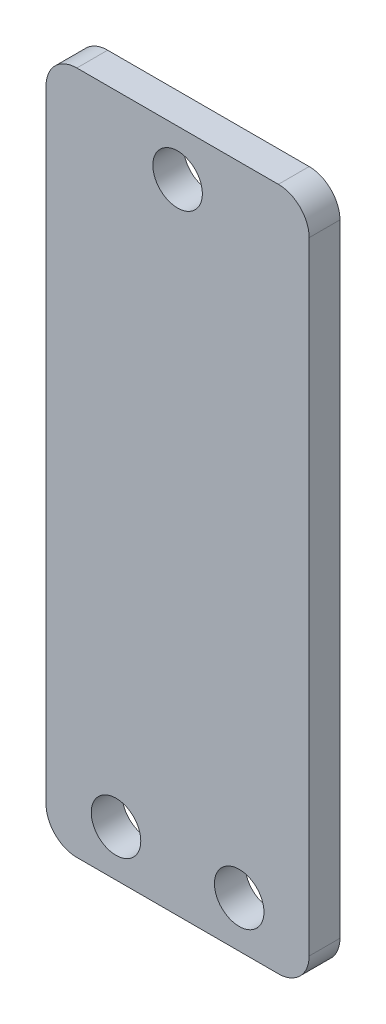
ISO-10303-21;
HEADER;
FILE_DESCRIPTION(('STEP AP214'),'2;1');
FILE_NAME('part.step','',(''),(''),'','','');
FILE_SCHEMA(('AUTOMOTIVE_DESIGN { 1 0 10303 214 1 1 1 1 }'));
ENDSEC;
DATA;
#1=APPLICATION_CONTEXT('core data for automotive mechanical design processes');
#2=APPLICATION_PROTOCOL_DEFINITION('international standard','automotive_design',2000,#1);
#3=PRODUCT_CONTEXT('',#1,'mechanical');
#4=PRODUCT('Part','Part','',(#3));
#5=PRODUCT_RELATED_PRODUCT_CATEGORY('part','',(#4));
#6=PRODUCT_DEFINITION_FORMATION('','',#4);
#7=PRODUCT_DEFINITION_CONTEXT('part definition',#1,'design');
#8=PRODUCT_DEFINITION('design','',#6,#7);
#9=PRODUCT_DEFINITION_SHAPE('','',#8);
#10=(LENGTH_UNIT() NAMED_UNIT(*) SI_UNIT(.MILLI.,.METRE.));
#11=(NAMED_UNIT(*) PLANE_ANGLE_UNIT() SI_UNIT($,.RADIAN.));
#12=(NAMED_UNIT(*) SI_UNIT($,.STERADIAN.) SOLID_ANGLE_UNIT());
#13=UNCERTAINTY_MEASURE_WITH_UNIT(LENGTH_MEASURE(1.E-05),#10,'distance_accuracy_value','');
#14=(GEOMETRIC_REPRESENTATION_CONTEXT(3) GLOBAL_UNCERTAINTY_ASSIGNED_CONTEXT((#13)) GLOBAL_UNIT_ASSIGNED_CONTEXT((#10,
#11,#12)) REPRESENTATION_CONTEXT('',''));
#15=CARTESIAN_POINT('',(0.,0.,0.));
#16=DIRECTION('',(0.,0.,1.));
#17=DIRECTION('',(1.,0.,0.));
#18=AXIS2_PLACEMENT_3D('',#15,#16,#17);
#19=CARTESIAN_POINT('',(10.3886,62.6618,3.175));
#20=DIRECTION('',(0.,0.,-1.));
#21=DIRECTION('',(-1.,0.,0.));
#22=AXIS2_PLACEMENT_3D('',#19,#20,#21);
#23=CYLINDRICAL_SURFACE('',#22,3.175);
#24=CARTESIAN_POINT('',(10.3886,62.6618,0.));
#25=DIRECTION('',(0.,0.,1.));
#26=DIRECTION('',(1.,0.,0.));
#27=AXIS2_PLACEMENT_3D('',#24,#25,#26);
#28=CIRCLE('',#27,3.175);
#29=CARTESIAN_POINT('',(13.5636,62.6617999999999,0.));
#30=VERTEX_POINT('',#29);
#31=CARTESIAN_POINT('',(10.3886,65.8368,0.));
#32=VERTEX_POINT('',#31);
#33=EDGE_CURVE('E129',#30,#32,#28,.T.);
#34=ORIENTED_EDGE('',*,*,#33,.T.);
#35=DIRECTION('',(0.,0.,-1.));
#36=VECTOR('',#35,1.);
#37=CARTESIAN_POINT('',(10.3886,65.8368,3.175));
#38=LINE('',#37,#36);
#39=CARTESIAN_POINT('',(10.3886,65.8368,3.175));
#40=VERTEX_POINT('',#39);
#41=EDGE_CURVE('E11',#40,#32,#38,.T.);
#42=ORIENTED_EDGE('',*,*,#41,.F.);
#43=CARTESIAN_POINT('',(10.3886,62.6618,3.175));
#44=DIRECTION('',(0.,0.,1.));
#45=DIRECTION('',(1.,0.,0.));
#46=AXIS2_PLACEMENT_3D('',#43,#44,#45);
#47=CIRCLE('',#46,3.175);
#48=CARTESIAN_POINT('',(13.5636,62.6617999999999,3.175));
#49=VERTEX_POINT('',#48);
#50=EDGE_CURVE('E144',#49,#40,#47,.T.);
#51=ORIENTED_EDGE('',*,*,#50,.F.);
#52=DIRECTION('',(0.,0.,-1.));
#53=VECTOR('',#52,1.);
#54=CARTESIAN_POINT('',(13.5636,62.6617999999999,3.175));
#55=LINE('',#54,#53);
#56=EDGE_CURVE('E125',#49,#30,#55,.T.);
#57=ORIENTED_EDGE('',*,*,#56,.T.);
#58=EDGE_LOOP('',(#34,#42,#51,#57));
#59=FACE_BOUND('',#58,.T.);
#60=ADVANCED_FACE('F33',(#59),#23,.T.);
#61=CARTESIAN_POINT('',(10.3886,65.8368,3.175));
#62=DIRECTION('',(0.,-1.,0.));
#63=DIRECTION('',(0.,0.,-1.));
#64=AXIS2_PLACEMENT_3D('',#61,#62,#63);
#65=PLANE('',#64);
#66=DIRECTION('',(-1.,0.,0.));
#67=VECTOR('',#66,1.);
#68=CARTESIAN_POINT('',(10.3886,65.8368,0.));
#69=LINE('',#68,#67);
#70=CARTESIAN_POINT('',(-10.3886,65.8368,0.));
#71=VERTEX_POINT('',#70);
#72=EDGE_CURVE('E132',#32,#71,#69,.T.);
#73=ORIENTED_EDGE('',*,*,#72,.T.);
#74=DIRECTION('',(0.,0.,-1.));
#75=VECTOR('',#74,1.);
#76=CARTESIAN_POINT('',(-10.3886,65.8368,3.175));
#77=LINE('',#76,#75);
#78=CARTESIAN_POINT('',(-10.3886,65.8368,3.175));
#79=VERTEX_POINT('',#78);
#80=EDGE_CURVE('E41',#79,#71,#77,.T.);
#81=ORIENTED_EDGE('',*,*,#80,.F.);
#82=DIRECTION('',(-1.,0.,0.));
#83=VECTOR('',#82,1.);
#84=CARTESIAN_POINT('',(10.3886,65.8368,3.175));
#85=LINE('',#84,#83);
#86=EDGE_CURVE('E92',#40,#79,#85,.T.);
#87=ORIENTED_EDGE('',*,*,#86,.F.);
#88=ORIENTED_EDGE('',*,*,#41,.T.);
#89=EDGE_LOOP('',(#73,#81,#87,#88));
#90=FACE_BOUND('',#89,.T.);
#91=ADVANCED_FACE('F220',(#90),#65,.F.);
#92=CARTESIAN_POINT('',(-10.3886,62.6618,3.175));
#93=DIRECTION('',(0.,0.,-1.));
#94=DIRECTION('',(-1.,0.,0.));
#95=AXIS2_PLACEMENT_3D('',#92,#93,#94);
#96=CYLINDRICAL_SURFACE('',#95,3.175);
#97=CARTESIAN_POINT('',(-10.3886,62.6618,0.));
#98=DIRECTION('',(0.,0.,1.));
#99=DIRECTION('',(1.,0.,0.));
#100=AXIS2_PLACEMENT_3D('',#97,#98,#99);
#101=CIRCLE('',#100,3.175);
#102=CARTESIAN_POINT('',(-13.5636,62.6617999999999,0.));
#103=VERTEX_POINT('',#102);
#104=EDGE_CURVE('E135',#71,#103,#101,.T.);
#105=ORIENTED_EDGE('',*,*,#104,.T.);
#106=DIRECTION('',(0.,0.,-1.));
#107=VECTOR('',#106,1.);
#108=CARTESIAN_POINT('',(-13.5636,62.6617999999999,3.175));
#109=LINE('',#108,#107);
#110=CARTESIAN_POINT('',(-13.5636,62.6617999999999,3.175));
#111=VERTEX_POINT('',#110);
#112=EDGE_CURVE('E151',#111,#103,#109,.T.);
#113=ORIENTED_EDGE('',*,*,#112,.F.);
#114=CARTESIAN_POINT('',(-10.3886,62.6618,3.175));
#115=DIRECTION('',(0.,0.,1.));
#116=DIRECTION('',(1.,0.,0.));
#117=AXIS2_PLACEMENT_3D('',#114,#115,#116);
#118=CIRCLE('',#117,3.175);
#119=EDGE_CURVE('E159',#79,#111,#118,.T.);
#120=ORIENTED_EDGE('',*,*,#119,.F.);
#121=ORIENTED_EDGE('',*,*,#80,.T.);
#122=EDGE_LOOP('',(#105,#113,#120,#121));
#123=FACE_BOUND('',#122,.T.);
#124=ADVANCED_FACE('F157',(#123),#96,.T.);
#125=CARTESIAN_POINT('',(-13.5636,-1.48589999999994,3.175));
#126=DIRECTION('',(1.,0.,0.));
#127=DIRECTION('',(0.,0.,-1.));
#128=AXIS2_PLACEMENT_3D('',#125,#126,#127);
#129=PLANE('',#128);
#130=DIRECTION('',(0.,-1.,0.));
#131=VECTOR('',#130,1.);
#132=CARTESIAN_POINT('',(-13.5636,-1.48589999999994,0.));
#133=LINE('',#132,#131);
#134=CARTESIAN_POINT('',(-13.5636,-1.48589999999996,0.));
#135=VERTEX_POINT('',#134);
#136=EDGE_CURVE('E137',#103,#135,#133,.T.);
#137=ORIENTED_EDGE('',*,*,#136,.T.);
#138=DIRECTION('',(0.,0.,-1.));
#139=VECTOR('',#138,1.);
#140=CARTESIAN_POINT('',(-13.5636,-1.48589999999996,3.175));
#141=LINE('',#140,#139);
#142=CARTESIAN_POINT('',(-13.5636,-1.48589999999996,3.175));
#143=VERTEX_POINT('',#142);
#144=EDGE_CURVE('E148',#143,#135,#141,.T.);
#145=ORIENTED_EDGE('',*,*,#144,.F.);
#146=DIRECTION('',(0.,-1.,0.));
#147=VECTOR('',#146,1.);
#148=CARTESIAN_POINT('',(-13.5636,-1.48589999999994,3.175));
#149=LINE('',#148,#147);
#150=EDGE_CURVE('E171',#111,#143,#149,.T.);
#151=ORIENTED_EDGE('',*,*,#150,.F.);
#152=ORIENTED_EDGE('',*,*,#112,.T.);
#153=EDGE_LOOP('',(#137,#145,#151,#152));
#154=FACE_BOUND('',#153,.T.);
#155=ADVANCED_FACE('F167',(#154),#129,.F.);
#156=CARTESIAN_POINT('',(-10.3886,-1.48589999999996,3.175));
#157=DIRECTION('',(0.,0.,-1.));
#158=DIRECTION('',(-1.,0.,0.));
#159=AXIS2_PLACEMENT_3D('',#156,#157,#158);
#160=CYLINDRICAL_SURFACE('',#159,3.175);
#161=CARTESIAN_POINT('',(-10.3886,-1.48589999999996,0.));
#162=DIRECTION('',(0.,0.,1.));
#163=DIRECTION('',(-1.,0.,0.));
#164=AXIS2_PLACEMENT_3D('',#161,#162,#163);
#165=CIRCLE('',#164,3.175);
#166=CARTESIAN_POINT('',(-10.3886,-4.66089999999996,0.));
#167=VERTEX_POINT('',#166);
#168=EDGE_CURVE('E139',#135,#167,#165,.T.);
#169=ORIENTED_EDGE('',*,*,#168,.T.);
#170=DIRECTION('',(0.,0.,-1.));
#171=VECTOR('',#170,1.);
#172=CARTESIAN_POINT('',(-10.3886,-4.66089999999996,3.175));
#173=LINE('',#172,#171);
#174=CARTESIAN_POINT('',(-10.3886,-4.66089999999996,3.175));
#175=VERTEX_POINT('',#174);
#176=EDGE_CURVE('E120',#175,#167,#173,.T.);
#177=ORIENTED_EDGE('',*,*,#176,.F.);
#178=CARTESIAN_POINT('',(-10.3886,-1.48589999999996,3.175));
#179=DIRECTION('',(0.,0.,1.));
#180=DIRECTION('',(-1.,0.,0.));
#181=AXIS2_PLACEMENT_3D('',#178,#179,#180);
#182=CIRCLE('',#181,3.175);
#183=EDGE_CURVE('E111',#143,#175,#182,.T.);
#184=ORIENTED_EDGE('',*,*,#183,.F.);
#185=ORIENTED_EDGE('',*,*,#144,.T.);
#186=EDGE_LOOP('',(#169,#177,#184,#185));
#187=FACE_BOUND('',#186,.T.);
#188=ADVANCED_FACE('F170',(#187),#160,.T.);
#189=CARTESIAN_POINT('',(10.3886,-4.66089999999996,3.175));
#190=DIRECTION('',(0.,1.,0.));
#191=DIRECTION('',(-1.,0.,0.));
#192=AXIS2_PLACEMENT_3D('',#189,#190,#191);
#193=PLANE('',#192);
#194=DIRECTION('',(1.,0.,0.));
#195=VECTOR('',#194,1.);
#196=CARTESIAN_POINT('',(10.3886,-4.66089999999996,0.));
#197=LINE('',#196,#195);
#198=CARTESIAN_POINT('',(10.3886,-4.66089999999996,0.));
#199=VERTEX_POINT('',#198);
#200=EDGE_CURVE('E119',#167,#199,#197,.T.);
#201=ORIENTED_EDGE('',*,*,#200,.T.);
#202=DIRECTION('',(0.,0.,-1.));
#203=VECTOR('',#202,1.);
#204=CARTESIAN_POINT('',(10.3886,-4.66089999999996,3.175));
#205=LINE('',#204,#203);
#206=CARTESIAN_POINT('',(10.3886,-4.66089999999996,3.175));
#207=VERTEX_POINT('',#206);
#208=EDGE_CURVE('E116',#207,#199,#205,.T.);
#209=ORIENTED_EDGE('',*,*,#208,.F.);
#210=DIRECTION('',(1.,0.,0.));
#211=VECTOR('',#210,1.);
#212=CARTESIAN_POINT('',(10.3886,-4.66089999999996,3.175));
#213=LINE('',#212,#211);
#214=EDGE_CURVE('E105',#175,#207,#213,.T.);
#215=ORIENTED_EDGE('',*,*,#214,.F.);
#216=ORIENTED_EDGE('',*,*,#176,.T.);
#217=EDGE_LOOP('',(#201,#209,#215,#216));
#218=FACE_BOUND('',#217,.T.);
#219=ADVANCED_FACE('F117',(#218),#193,.F.);
#220=CARTESIAN_POINT('',(10.3886,-1.48589999999996,3.175));
#221=DIRECTION('',(0.,0.,-1.));
#222=DIRECTION('',(-1.,0.,0.));
#223=AXIS2_PLACEMENT_3D('',#220,#221,#222);
#224=CYLINDRICAL_SURFACE('',#223,3.175);
#225=CARTESIAN_POINT('',(10.3886,-1.48589999999996,0.));
#226=DIRECTION('',(0.,0.,1.));
#227=DIRECTION('',(1.,0.,0.));
#228=AXIS2_PLACEMENT_3D('',#225,#226,#227);
#229=CIRCLE('',#228,3.175);
#230=CARTESIAN_POINT('',(13.5636,-1.48589999999994,0.));
#231=VERTEX_POINT('',#230);
#232=EDGE_CURVE('E78',#199,#231,#229,.T.);
#233=ORIENTED_EDGE('',*,*,#232,.T.);
#234=DIRECTION('',(0.,0.,-1.));
#235=VECTOR('',#234,1.);
#236=CARTESIAN_POINT('',(13.5636,-1.48589999999994,3.175));
#237=LINE('',#236,#235);
#238=CARTESIAN_POINT('',(13.5636,-1.48589999999994,3.175));
#239=VERTEX_POINT('',#238);
#240=EDGE_CURVE('E121',#239,#231,#237,.T.);
#241=ORIENTED_EDGE('',*,*,#240,.F.);
#242=CARTESIAN_POINT('',(10.3886,-1.48589999999996,3.175));
#243=DIRECTION('',(0.,0.,1.));
#244=DIRECTION('',(1.,0.,0.));
#245=AXIS2_PLACEMENT_3D('',#242,#243,#244);
#246=CIRCLE('',#245,3.175);
#247=EDGE_CURVE('E109',#207,#239,#246,.T.);
#248=ORIENTED_EDGE('',*,*,#247,.F.);
#249=ORIENTED_EDGE('',*,*,#208,.T.);
#250=EDGE_LOOP('',(#233,#241,#248,#249));
#251=FACE_BOUND('',#250,.T.);
#252=ADVANCED_FACE('F123',(#251),#224,.T.);
#253=CARTESIAN_POINT('',(13.5636,-1.48589999999994,3.175));
#254=DIRECTION('',(-1.,0.,0.));
#255=DIRECTION('',(0.,0.,1.));
#256=AXIS2_PLACEMENT_3D('',#253,#254,#255);
#257=PLANE('',#256);
#258=DIRECTION('',(0.,1.,0.));
#259=VECTOR('',#258,1.);
#260=CARTESIAN_POINT('',(13.5636,-1.48589999999994,0.));
#261=LINE('',#260,#259);
#262=EDGE_CURVE('E84',#231,#30,#261,.T.);
#263=ORIENTED_EDGE('',*,*,#262,.T.);
#264=ORIENTED_EDGE('',*,*,#56,.F.);
#265=DIRECTION('',(0.,1.,0.));
#266=VECTOR('',#265,1.);
#267=CARTESIAN_POINT('',(13.5636,-1.48589999999994,3.175));
#268=LINE('',#267,#266);
#269=EDGE_CURVE('E49',#239,#49,#268,.T.);
#270=ORIENTED_EDGE('',*,*,#269,.F.);
#271=ORIENTED_EDGE('',*,*,#240,.T.);
#272=EDGE_LOOP('',(#263,#264,#270,#271));
#273=FACE_BOUND('',#272,.T.);
#274=ADVANCED_FACE('F199',(#273),#257,.F.);
#275=CARTESIAN_POINT('',(10.3886,62.6618,3.175));
#276=DIRECTION('',(0.,0.,1.));
#277=DIRECTION('',(1.,0.,0.));
#278=AXIS2_PLACEMENT_3D('',#275,#276,#277);
#279=PLANE('',#278);
#280=CARTESIAN_POINT('',(6.35,0.101600000000035,3.175));
#281=DIRECTION('',(0.,0.,1.));
#282=DIRECTION('',(1.,0.,0.));
#283=AXIS2_PLACEMENT_3D('',#280,#281,#282);
#284=CIRCLE('',#283,2.55269999999999);
#285=CARTESIAN_POINT('',(8.90269999999999,0.101600000000035,3.175));
#286=VERTEX_POINT('',#285);
#287=EDGE_CURVE('E191',#286,#286,#284,.T.);
#288=ORIENTED_EDGE('',*,*,#287,.F.);
#289=EDGE_LOOP('',(#288));
#290=FACE_BOUND('',#289,.T.);
#291=CARTESIAN_POINT('',(-6.35,0.101600000000035,3.175));
#292=DIRECTION('',(0.,0.,1.));
#293=DIRECTION('',(1.,0.,0.));
#294=AXIS2_PLACEMENT_3D('',#291,#292,#293);
#295=CIRCLE('',#294,2.55269999999999);
#296=CARTESIAN_POINT('',(-3.79730000000001,0.101600000000035,3.175));
#297=VERTEX_POINT('',#296);
#298=EDGE_CURVE('E185',#297,#297,#295,.T.);
#299=ORIENTED_EDGE('',*,*,#298,.F.);
#300=EDGE_LOOP('',(#299));
#301=FACE_BOUND('',#300,.T.);
#302=CARTESIAN_POINT('',(0.,61.0743,3.175));
#303=DIRECTION('',(0.,0.,1.));
#304=DIRECTION('',(1.,0.,0.));
#305=AXIS2_PLACEMENT_3D('',#302,#303,#304);
#306=CIRCLE('',#305,2.55269999999999);
#307=CARTESIAN_POINT('',(2.55269999999999,61.0743,3.175));
#308=VERTEX_POINT('',#307);
#309=EDGE_CURVE('E179',#308,#308,#306,.T.);
#310=ORIENTED_EDGE('',*,*,#309,.F.);
#311=EDGE_LOOP('',(#310));
#312=FACE_BOUND('',#311,.T.);
#313=ORIENTED_EDGE('',*,*,#50,.T.);
#314=ORIENTED_EDGE('',*,*,#86,.T.);
#315=ORIENTED_EDGE('',*,*,#119,.T.);
#316=ORIENTED_EDGE('',*,*,#150,.T.);
#317=ORIENTED_EDGE('',*,*,#183,.T.);
#318=ORIENTED_EDGE('',*,*,#214,.T.);
#319=ORIENTED_EDGE('',*,*,#247,.T.);
#320=ORIENTED_EDGE('',*,*,#269,.T.);
#321=EDGE_LOOP('',(#313,#314,#315,#316,#317,#318,#319,#320));
#322=FACE_BOUND('',#321,.T.);
#323=ADVANCED_FACE('F107',(#290,#301,#312,#322),#279,.T.);
#324=CARTESIAN_POINT('',(10.3886,62.6618,0.));
#325=DIRECTION('',(0.,0.,1.));
#326=DIRECTION('',(1.,0.,0.));
#327=AXIS2_PLACEMENT_3D('',#324,#325,#326);
#328=PLANE('',#327);
#329=CARTESIAN_POINT('',(6.35,0.101600000000035,0.));
#330=DIRECTION('',(0.,0.,1.));
#331=DIRECTION('',(1.,0.,0.));
#332=AXIS2_PLACEMENT_3D('',#329,#330,#331);
#333=CIRCLE('',#332,2.5527);
#334=CARTESIAN_POINT('',(8.9027,0.101600000000035,0.));
#335=VERTEX_POINT('',#334);
#336=EDGE_CURVE('E188',#335,#335,#333,.T.);
#337=ORIENTED_EDGE('',*,*,#336,.T.);
#338=EDGE_LOOP('',(#337));
#339=FACE_BOUND('',#338,.T.);
#340=CARTESIAN_POINT('',(-6.35,0.101600000000035,0.));
#341=DIRECTION('',(0.,0.,1.));
#342=DIRECTION('',(1.,0.,0.));
#343=AXIS2_PLACEMENT_3D('',#340,#341,#342);
#344=CIRCLE('',#343,2.5527);
#345=CARTESIAN_POINT('',(-3.7973,0.101600000000035,0.));
#346=VERTEX_POINT('',#345);
#347=EDGE_CURVE('E182',#346,#346,#344,.T.);
#348=ORIENTED_EDGE('',*,*,#347,.T.);
#349=EDGE_LOOP('',(#348));
#350=FACE_BOUND('',#349,.T.);
#351=CARTESIAN_POINT('',(0.,61.0743,0.));
#352=DIRECTION('',(0.,0.,1.));
#353=DIRECTION('',(1.,0.,0.));
#354=AXIS2_PLACEMENT_3D('',#351,#352,#353);
#355=CIRCLE('',#354,2.5527);
#356=CARTESIAN_POINT('',(2.5527,61.0743,0.));
#357=VERTEX_POINT('',#356);
#358=EDGE_CURVE('E133',#357,#357,#355,.T.);
#359=ORIENTED_EDGE('',*,*,#358,.T.);
#360=EDGE_LOOP('',(#359));
#361=FACE_BOUND('',#360,.T.);
#362=ORIENTED_EDGE('',*,*,#33,.F.);
#363=ORIENTED_EDGE('',*,*,#262,.F.);
#364=ORIENTED_EDGE('',*,*,#232,.F.);
#365=ORIENTED_EDGE('',*,*,#200,.F.);
#366=ORIENTED_EDGE('',*,*,#168,.F.);
#367=ORIENTED_EDGE('',*,*,#136,.F.);
#368=ORIENTED_EDGE('',*,*,#104,.F.);
#369=ORIENTED_EDGE('',*,*,#72,.F.);
#370=EDGE_LOOP('',(#362,#363,#364,#365,#366,#367,#368,#369));
#371=FACE_BOUND('',#370,.T.);
#372=ADVANCED_FACE('F163',(#339,#350,#361,#371),#328,.F.);
#373=CARTESIAN_POINT('',(0.,61.0743,3.175));
#374=DIRECTION('',(0.,0.,1.));
#375=DIRECTION('',(1.,0.,0.));
#376=AXIS2_PLACEMENT_3D('',#373,#374,#375);
#377=CYLINDRICAL_SURFACE('',#376,2.55269999999999);
#378=ORIENTED_EDGE('',*,*,#358,.F.);
#379=EDGE_LOOP('',(#378));
#380=FACE_BOUND('',#379,.T.);
#381=ORIENTED_EDGE('',*,*,#309,.T.);
#382=EDGE_LOOP('',(#381));
#383=FACE_BOUND('',#382,.T.);
#384=ADVANCED_FACE('F205',(#380,#383),#377,.F.);
#385=CARTESIAN_POINT('',(-6.35,0.101600000000035,3.175));
#386=DIRECTION('',(0.,0.,1.));
#387=DIRECTION('',(1.,0.,0.));
#388=AXIS2_PLACEMENT_3D('',#385,#386,#387);
#389=CYLINDRICAL_SURFACE('',#388,2.55269999999999);
#390=ORIENTED_EDGE('',*,*,#347,.F.);
#391=EDGE_LOOP('',(#390));
#392=FACE_BOUND('',#391,.T.);
#393=ORIENTED_EDGE('',*,*,#298,.T.);
#394=EDGE_LOOP('',(#393));
#395=FACE_BOUND('',#394,.T.);
#396=ADVANCED_FACE('F207',(#392,#395),#389,.F.);
#397=CARTESIAN_POINT('',(6.35,0.101600000000035,3.175));
#398=DIRECTION('',(0.,0.,1.));
#399=DIRECTION('',(1.,0.,0.));
#400=AXIS2_PLACEMENT_3D('',#397,#398,#399);
#401=CYLINDRICAL_SURFACE('',#400,2.55269999999999);
#402=ORIENTED_EDGE('',*,*,#336,.F.);
#403=EDGE_LOOP('',(#402));
#404=FACE_BOUND('',#403,.T.);
#405=ORIENTED_EDGE('',*,*,#287,.T.);
#406=EDGE_LOOP('',(#405));
#407=FACE_BOUND('',#406,.T.);
#408=ADVANCED_FACE('F195',(#404,#407),#401,.F.);
#409=CLOSED_SHELL('',(#60,#91,#124,#155,#188,#219,#252,#274,#323,#372,#384,#396,#408));
#410=MANIFOLD_SOLID_BREP('B2',#409);
#411=ADVANCED_BREP_SHAPE_REPRESENTATION('',(#18,#410),#14);
#412=SHAPE_DEFINITION_REPRESENTATION(#9,#411);
ENDSEC;
END-ISO-10303-21;
